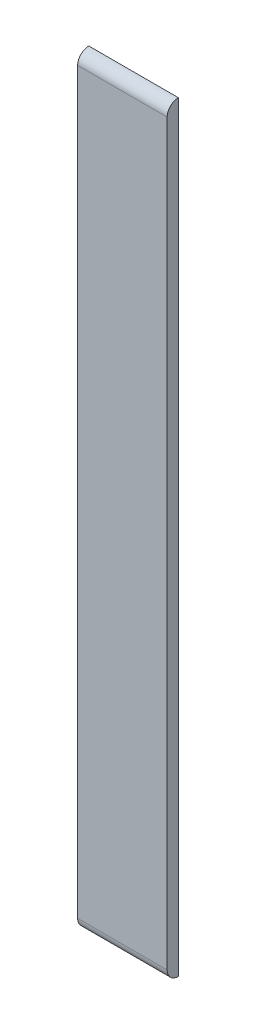
ISO-10303-21;
HEADER;
FILE_DESCRIPTION(('STEP AP214'),'2;1');
FILE_NAME('part.step','',(''),(''),'','','');
FILE_SCHEMA(('AUTOMOTIVE_DESIGN { 1 0 10303 214 1 1 1 1 }'));
ENDSEC;
DATA;
#1=APPLICATION_CONTEXT('core data for automotive mechanical design processes');
#2=APPLICATION_PROTOCOL_DEFINITION('international standard','automotive_design',2000,#1);
#3=PRODUCT_CONTEXT('',#1,'mechanical');
#4=PRODUCT('Part','Part','',(#3));
#5=PRODUCT_RELATED_PRODUCT_CATEGORY('part','',(#4));
#6=PRODUCT_DEFINITION_FORMATION('','',#4);
#7=PRODUCT_DEFINITION_CONTEXT('part definition',#1,'design');
#8=PRODUCT_DEFINITION('design','',#6,#7);
#9=PRODUCT_DEFINITION_SHAPE('','',#8);
#10=(LENGTH_UNIT() NAMED_UNIT(*) SI_UNIT(.MILLI.,.METRE.));
#11=(NAMED_UNIT(*) PLANE_ANGLE_UNIT() SI_UNIT($,.RADIAN.));
#12=(NAMED_UNIT(*) SI_UNIT($,.STERADIAN.) SOLID_ANGLE_UNIT());
#13=UNCERTAINTY_MEASURE_WITH_UNIT(LENGTH_MEASURE(1.E-05),#10,'distance_accuracy_value','');
#14=(GEOMETRIC_REPRESENTATION_CONTEXT(3) GLOBAL_UNCERTAINTY_ASSIGNED_CONTEXT((#13)) GLOBAL_UNIT_ASSIGNED_CONTEXT((#10,
#11,#12)) REPRESENTATION_CONTEXT('',''));
#15=CARTESIAN_POINT('',(0.,0.,0.));
#16=DIRECTION('',(0.,0.,1.));
#17=DIRECTION('',(1.,0.,0.));
#18=AXIS2_PLACEMENT_3D('',#15,#16,#17);
#19=CARTESIAN_POINT('',(-1.05,0.,1.2));
#20=DIRECTION('',(0.,0.,1.));
#21=DIRECTION('',(1.,0.,0.));
#22=AXIS2_PLACEMENT_3D('',#19,#20,#21);
#23=PLANE('',#22);
#24=DIRECTION('',(-1.,0.,0.));
#25=VECTOR('',#24,1.);
#26=CARTESIAN_POINT('',(-1.,0.825,1.2));
#27=LINE('',#26,#25);
#28=CARTESIAN_POINT('',(-1.15,0.825,1.2));
#29=VERTEX_POINT('',#28);
#30=CARTESIAN_POINT('',(-0.95,0.825,1.2));
#31=VERTEX_POINT('',#30);
#32=EDGE_CURVE('E81',#29,#31,#27,.F.);
#33=ORIENTED_EDGE('',*,*,#32,.F.);
#34=DIRECTION('',(0.,1.,0.));
#35=VECTOR('',#34,1.);
#36=CARTESIAN_POINT('',(-1.15,0.85,1.2));
#37=LINE('',#36,#35);
#38=CARTESIAN_POINT('',(-1.15,-0.825,1.2));
#39=VERTEX_POINT('',#38);
#40=EDGE_CURVE('E64',#39,#29,#37,.T.);
#41=ORIENTED_EDGE('',*,*,#40,.F.);
#42=DIRECTION('',(1.,0.,0.));
#43=VECTOR('',#42,1.);
#44=CARTESIAN_POINT('',(-1.1,-0.825,1.2));
#45=LINE('',#44,#43);
#46=CARTESIAN_POINT('',(-0.95,-0.825,1.2));
#47=VERTEX_POINT('',#46);
#48=EDGE_CURVE('E61',#47,#39,#45,.F.);
#49=ORIENTED_EDGE('',*,*,#48,.F.);
#50=DIRECTION('',(0.,1.,0.));
#51=VECTOR('',#50,1.);
#52=CARTESIAN_POINT('',(-0.95,-0.85,1.2));
#53=LINE('',#52,#51);
#54=EDGE_CURVE('E74',#31,#47,#53,.F.);
#55=ORIENTED_EDGE('',*,*,#54,.F.);
#56=EDGE_LOOP('',(#33,#41,#49,#55));
#57=FACE_BOUND('',#56,.T.);
#58=ADVANCED_FACE('F17',(#57),#23,.T.);
#59=CARTESIAN_POINT('',(-1.1,-0.825,1.175));
#60=DIRECTION('',(1.,0.,0.));
#61=DIRECTION('',(0.,0.,-1.));
#62=AXIS2_PLACEMENT_3D('',#59,#60,#61);
#63=CYLINDRICAL_SURFACE('',#62,0.025);
#64=CARTESIAN_POINT('',(-1.15,-0.825,1.175));
#65=DIRECTION('',(1.,0.,0.));
#66=DIRECTION('',(0.,0.,-1.));
#67=AXIS2_PLACEMENT_3D('',#64,#65,#66);
#68=CIRCLE('',#67,0.025);
#69=CARTESIAN_POINT('',(-1.15,-0.85,1.175));
#70=VERTEX_POINT('',#69);
#71=EDGE_CURVE('E20',#70,#39,#68,.F.);
#72=ORIENTED_EDGE('',*,*,#71,.F.);
#73=DIRECTION('',(-1.,0.,0.));
#74=VECTOR('',#73,1.);
#75=CARTESIAN_POINT('',(-1.05,-0.85,1.175));
#76=LINE('',#75,#74);
#77=CARTESIAN_POINT('',(-0.95,-0.85,1.175));
#78=VERTEX_POINT('',#77);
#79=EDGE_CURVE('E59',#78,#70,#76,.T.);
#80=ORIENTED_EDGE('',*,*,#79,.F.);
#81=CARTESIAN_POINT('',(-0.95,-0.825,1.175));
#82=DIRECTION('',(1.,0.,0.));
#83=DIRECTION('',(0.,0.,-1.));
#84=AXIS2_PLACEMENT_3D('',#81,#82,#83);
#85=CIRCLE('',#84,0.025);
#86=EDGE_CURVE('E83',#47,#78,#85,.T.);
#87=ORIENTED_EDGE('',*,*,#86,.F.);
#88=ORIENTED_EDGE('',*,*,#48,.T.);
#89=EDGE_LOOP('',(#72,#80,#87,#88));
#90=FACE_BOUND('',#89,.T.);
#91=ADVANCED_FACE('F56',(#90),#63,.T.);
#92=CARTESIAN_POINT('',(-1.15,0.85,1.19));
#93=DIRECTION('',(-1.,0.,0.));
#94=DIRECTION('',(0.,0.,1.));
#95=AXIS2_PLACEMENT_3D('',#92,#93,#94);
#96=PLANE('',#95);
#97=CARTESIAN_POINT('',(-1.15,0.825,1.175));
#98=DIRECTION('',(-1.,0.,0.));
#99=DIRECTION('',(0.,0.,1.));
#100=AXIS2_PLACEMENT_3D('',#97,#98,#99);
#101=CIRCLE('',#100,0.025);
#102=CARTESIAN_POINT('',(-1.15,0.85,1.175));
#103=VERTEX_POINT('',#102);
#104=EDGE_CURVE('E69',#103,#29,#101,.F.);
#105=ORIENTED_EDGE('',*,*,#104,.F.);
#106=DIRECTION('',(0.,1.,0.));
#107=VECTOR('',#106,1.);
#108=CARTESIAN_POINT('',(-1.15,0.,1.175));
#109=LINE('',#108,#107);
#110=EDGE_CURVE('E66',#70,#103,#109,.T.);
#111=ORIENTED_EDGE('',*,*,#110,.F.);
#112=ORIENTED_EDGE('',*,*,#71,.T.);
#113=ORIENTED_EDGE('',*,*,#40,.T.);
#114=EDGE_LOOP('',(#105,#111,#112,#113));
#115=FACE_BOUND('',#114,.T.);
#116=ADVANCED_FACE('F67',(#115),#96,.T.);
#117=CARTESIAN_POINT('',(-1.,0.825,1.175));
#118=DIRECTION('',(-1.,0.,0.));
#119=DIRECTION('',(0.,0.,1.));
#120=AXIS2_PLACEMENT_3D('',#117,#118,#119);
#121=CYLINDRICAL_SURFACE('',#120,0.025);
#122=CARTESIAN_POINT('',(-0.95,0.825,1.175));
#123=DIRECTION('',(-1.,0.,0.));
#124=DIRECTION('',(0.,0.,1.));
#125=AXIS2_PLACEMENT_3D('',#122,#123,#124);
#126=CIRCLE('',#125,0.025);
#127=CARTESIAN_POINT('',(-0.95,0.85,1.175));
#128=VERTEX_POINT('',#127);
#129=EDGE_CURVE('E35',#128,#31,#126,.F.);
#130=ORIENTED_EDGE('',*,*,#129,.F.);
#131=DIRECTION('',(-1.,0.,0.));
#132=VECTOR('',#131,1.);
#133=CARTESIAN_POINT('',(-1.05,0.85,1.175));
#134=LINE('',#133,#132);
#135=EDGE_CURVE('E26',#103,#128,#134,.F.);
#136=ORIENTED_EDGE('',*,*,#135,.F.);
#137=ORIENTED_EDGE('',*,*,#104,.T.);
#138=ORIENTED_EDGE('',*,*,#32,.T.);
#139=EDGE_LOOP('',(#130,#136,#137,#138));
#140=FACE_BOUND('',#139,.T.);
#141=ADVANCED_FACE('F86',(#140),#121,.T.);
#142=CARTESIAN_POINT('',(-0.95,-0.85,1.19));
#143=DIRECTION('',(1.,0.,0.));
#144=DIRECTION('',(0.,0.,-1.));
#145=AXIS2_PLACEMENT_3D('',#142,#143,#144);
#146=PLANE('',#145);
#147=ORIENTED_EDGE('',*,*,#129,.T.);
#148=ORIENTED_EDGE('',*,*,#54,.T.);
#149=ORIENTED_EDGE('',*,*,#86,.T.);
#150=DIRECTION('',(0.,1.,0.));
#151=VECTOR('',#150,1.);
#152=CARTESIAN_POINT('',(-0.95,0.,1.175));
#153=LINE('',#152,#151);
#154=EDGE_CURVE('E11',#128,#78,#153,.F.);
#155=ORIENTED_EDGE('',*,*,#154,.F.);
#156=EDGE_LOOP('',(#147,#148,#149,#155));
#157=FACE_BOUND('',#156,.T.);
#158=ADVANCED_FACE('F91',(#157),#146,.T.);
#159=CARTESIAN_POINT('',(-1.05,0.,1.175));
#160=DIRECTION('',(0.,0.,-1.));
#161=DIRECTION('',(-1.,0.,0.));
#162=AXIS2_PLACEMENT_3D('',#159,#160,#161);
#163=PLANE('',#162);
#164=ORIENTED_EDGE('',*,*,#135,.T.);
#165=ORIENTED_EDGE('',*,*,#154,.T.);
#166=ORIENTED_EDGE('',*,*,#79,.T.);
#167=ORIENTED_EDGE('',*,*,#110,.T.);
#168=EDGE_LOOP('',(#164,#165,#166,#167));
#169=FACE_BOUND('',#168,.T.);
#170=ADVANCED_FACE('F73',(#169),#163,.T.);
#171=CLOSED_SHELL('',(#58,#91,#116,#141,#158,#170));
#172=MANIFOLD_SOLID_BREP('B1',#171);
#173=ADVANCED_BREP_SHAPE_REPRESENTATION('',(#18,#172),#14);
#174=SHAPE_DEFINITION_REPRESENTATION(#9,#173);
ENDSEC;
END-ISO-10303-21;
